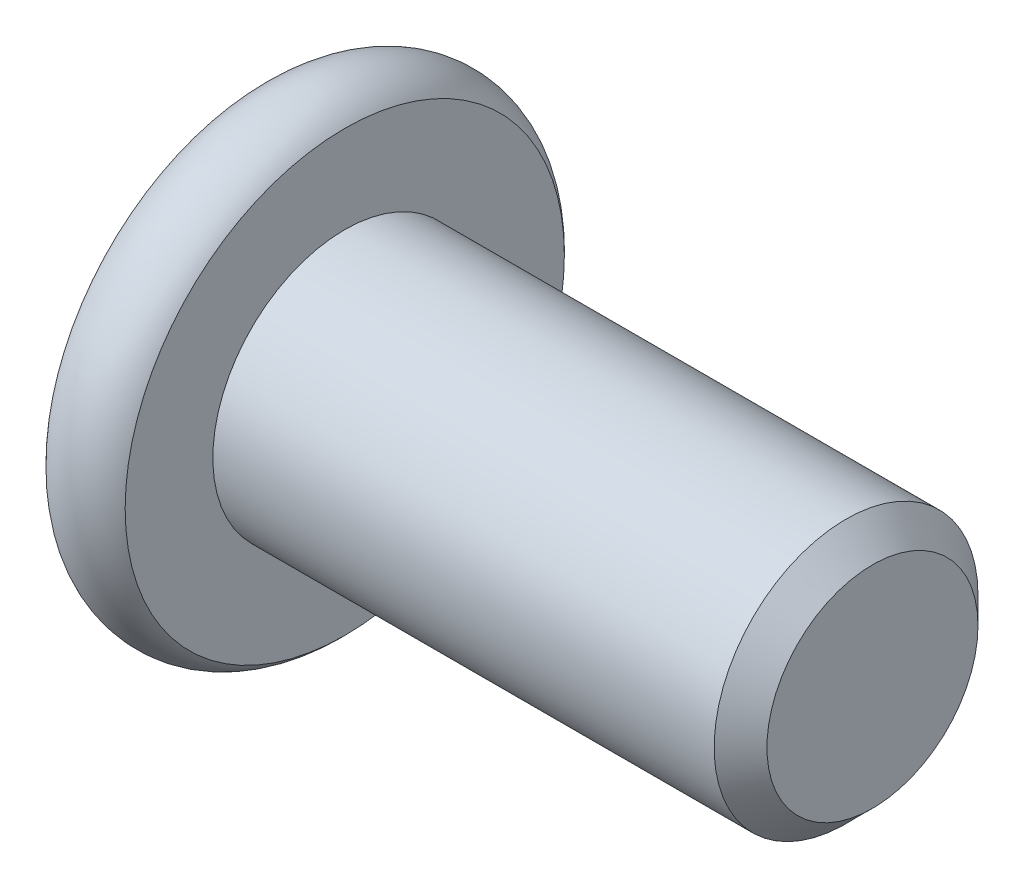
ISO-10303-21;
HEADER;
FILE_DESCRIPTION(('STEP AP214'),'2;1');
FILE_NAME('part.step','',(''),(''),'','','');
FILE_SCHEMA(('AUTOMOTIVE_DESIGN { 1 0 10303 214 1 1 1 1 }'));
ENDSEC;
DATA;
#1=APPLICATION_CONTEXT('core data for automotive mechanical design processes');
#2=APPLICATION_PROTOCOL_DEFINITION('international standard','automotive_design',2000,#1);
#3=PRODUCT_CONTEXT('',#1,'mechanical');
#4=PRODUCT('Part','Part','',(#3));
#5=PRODUCT_RELATED_PRODUCT_CATEGORY('part','',(#4));
#6=PRODUCT_DEFINITION_FORMATION('','',#4);
#7=PRODUCT_DEFINITION_CONTEXT('part definition',#1,'design');
#8=PRODUCT_DEFINITION('design','',#6,#7);
#9=PRODUCT_DEFINITION_SHAPE('','',#8);
#10=(LENGTH_UNIT() NAMED_UNIT(*) SI_UNIT(.MILLI.,.METRE.));
#11=(NAMED_UNIT(*) PLANE_ANGLE_UNIT() SI_UNIT($,.RADIAN.));
#12=(NAMED_UNIT(*) SI_UNIT($,.STERADIAN.) SOLID_ANGLE_UNIT());
#13=UNCERTAINTY_MEASURE_WITH_UNIT(LENGTH_MEASURE(1.E-05),#10,'distance_accuracy_value','');
#14=(GEOMETRIC_REPRESENTATION_CONTEXT(3) GLOBAL_UNCERTAINTY_ASSIGNED_CONTEXT((#13)) GLOBAL_UNIT_ASSIGNED_CONTEXT((#10,
#11,#12)) REPRESENTATION_CONTEXT('',''));
#15=CARTESIAN_POINT('',(0.,0.,0.));
#16=DIRECTION('',(0.,0.,1.));
#17=DIRECTION('',(1.,0.,0.));
#18=AXIS2_PLACEMENT_3D('',#15,#16,#17);
#19=CARTESIAN_POINT('',(-10.,0.,0.));
#20=DIRECTION('',(1.,0.,0.));
#21=DIRECTION('',(0.,0.,-1.));
#22=AXIS2_PLACEMENT_3D('',#19,#20,#21);
#23=CYLINDRICAL_SURFACE('',#22,2.5);
#24=CARTESIAN_POINT('',(-0.500000000000006,0.,0.));
#25=DIRECTION('',(1.,0.,0.));
#26=DIRECTION('',(0.,0.,-1.));
#27=AXIS2_PLACEMENT_3D('',#24,#25,#26);
#28=CIRCLE('',#27,2.5);
#29=CARTESIAN_POINT('',(-0.500000000000006,0.,-2.5));
#30=VERTEX_POINT('',#29);
#31=EDGE_CURVE('E49',#30,#30,#28,.F.);
#32=ORIENTED_EDGE('',*,*,#31,.T.);
#33=EDGE_LOOP('',(#32));
#34=FACE_BOUND('',#33,.T.);
#35=CARTESIAN_POINT('',(-10.,0.,0.));
#36=DIRECTION('',(1.,0.,0.));
#37=DIRECTION('',(0.,1.,0.));
#38=AXIS2_PLACEMENT_3D('',#35,#36,#37);
#39=CIRCLE('',#38,2.5);
#40=CARTESIAN_POINT('',(-10.,2.49999999999999,0.));
#41=VERTEX_POINT('',#40);
#42=EDGE_CURVE('E134',#41,#41,#39,.F.);
#43=ORIENTED_EDGE('',*,*,#42,.F.);
#44=EDGE_LOOP('',(#43));
#45=FACE_BOUND('',#44,.T.);
#46=ADVANCED_FACE('F35',(#34,#45),#23,.T.);
#47=CARTESIAN_POINT('',(0.,0.,0.));
#48=DIRECTION('',(1.,0.,0.));
#49=DIRECTION('',(0.,0.,-1.));
#50=AXIS2_PLACEMENT_3D('',#47,#48,#49);
#51=PLANE('',#50);
#52=CARTESIAN_POINT('',(0.,0.,0.));
#53=DIRECTION('',(1.,0.,0.));
#54=DIRECTION('',(0.,0.,-1.));
#55=AXIS2_PLACEMENT_3D('',#52,#53,#54);
#56=CIRCLE('',#55,1.99999999999999);
#57=CARTESIAN_POINT('',(0.,0.,-1.99999999999999));
#58=VERTEX_POINT('',#57);
#59=EDGE_CURVE('E138',#58,#58,#56,.T.);
#60=ORIENTED_EDGE('',*,*,#59,.T.);
#61=EDGE_LOOP('',(#60));
#62=FACE_BOUND('',#61,.T.);
#63=ADVANCED_FACE('F152',(#62),#51,.T.);
#64=CARTESIAN_POINT('',(0.,0.,0.));
#65=DIRECTION('',(-1.,0.,0.));
#66=DIRECTION('',(0.,0.,1.));
#67=AXIS2_PLACEMENT_3D('',#64,#65,#66);
#68=CONICAL_SURFACE('',#67,1.99999999999999,0.785398163397446);
#69=ORIENTED_EDGE('',*,*,#31,.F.);
#70=EDGE_LOOP('',(#69));
#71=FACE_BOUND('',#70,.T.);
#72=ORIENTED_EDGE('',*,*,#59,.F.);
#73=EDGE_LOOP('',(#72));
#74=FACE_BOUND('',#73,.T.);
#75=ADVANCED_FACE('F37',(#71,#74),#68,.T.);
#76=CARTESIAN_POINT('',(-11.5,0.,0.));
#77=DIRECTION('',(-1.,0.,0.));
#78=DIRECTION('',(0.,-1.,0.));
#79=AXIS2_PLACEMENT_3D('',#76,#77,#78);
#80=PLANE('',#79);
#81=CARTESIAN_POINT('',(-11.5,0.,0.));
#82=DIRECTION('',(-1.,0.,0.));
#83=DIRECTION('',(0.,-1.,0.));
#84=AXIS2_PLACEMENT_3D('',#81,#82,#83);
#85=CIRCLE('',#84,1.78205080756887);
#86=CARTESIAN_POINT('',(-11.5,-1.78205080756883,0.));
#87=VERTEX_POINT('',#86);
#88=EDGE_CURVE('E376',#87,#87,#85,.T.);
#89=ORIENTED_EDGE('',*,*,#88,.F.);
#90=EDGE_LOOP('',(#89));
#91=FACE_BOUND('',#90,.T.);
#92=CARTESIAN_POINT('',(-11.5,0.,0.));
#93=DIRECTION('',(1.,0.,0.));
#94=DIRECTION('',(0.,1.,0.));
#95=AXIS2_PLACEMENT_3D('',#92,#93,#94);
#96=CIRCLE('',#95,4.16143782776614);
#97=CARTESIAN_POINT('',(-11.5,4.16143782776614,0.));
#98=VERTEX_POINT('',#97);
#99=EDGE_CURVE('E130',#98,#98,#96,.T.);
#100=ORIENTED_EDGE('',*,*,#99,.F.);
#101=EDGE_LOOP('',(#100));
#102=FACE_BOUND('',#101,.T.);
#103=ADVANCED_FACE('F151',(#91,#102),#80,.T.);
#104=CARTESIAN_POINT('',(-10.75,0.,0.));
#105=DIRECTION('',(1.,0.,0.));
#106=DIRECTION('',(0.,1.,0.));
#107=AXIS2_PLACEMENT_3D('',#104,#105,#106);
#108=TOROIDAL_SURFACE('',#107,3.5,1.);
#109=ORIENTED_EDGE('',*,*,#99,.T.);
#110=EDGE_LOOP('',(#109));
#111=FACE_BOUND('',#110,.T.);
#112=CARTESIAN_POINT('',(-9.99999999999999,0.,0.));
#113=DIRECTION('',(1.,0.,0.));
#114=DIRECTION('',(0.,1.,0.));
#115=AXIS2_PLACEMENT_3D('',#112,#113,#114);
#116=CIRCLE('',#115,4.16143782776614);
#117=CARTESIAN_POINT('',(-10.,4.16143782776614,0.));
#118=VERTEX_POINT('',#117);
#119=EDGE_CURVE('E126',#118,#118,#116,.T.);
#120=ORIENTED_EDGE('',*,*,#119,.F.);
#121=EDGE_LOOP('',(#120));
#122=FACE_BOUND('',#121,.T.);
#123=ADVANCED_FACE('F163',(#111,#122),#108,.T.);
#124=CARTESIAN_POINT('',(-10.,4.16143782776614,0.));
#125=DIRECTION('',(1.,0.,0.));
#126=DIRECTION('',(0.,1.,0.));
#127=AXIS2_PLACEMENT_3D('',#124,#125,#126);
#128=PLANE('',#127);
#129=ORIENTED_EDGE('',*,*,#42,.T.);
#130=EDGE_LOOP('',(#129));
#131=FACE_BOUND('',#130,.T.);
#132=ORIENTED_EDGE('',*,*,#119,.T.);
#133=EDGE_LOOP('',(#132));
#134=FACE_BOUND('',#133,.T.);
#135=ADVANCED_FACE('F167',(#131,#134),#128,.T.);
#136=CARTESIAN_POINT('',(-11.5,0.,0.));
#137=DIRECTION('',(-1.,0.,0.));
#138=DIRECTION('',(0.,-1.,0.));
#139=AXIS2_PLACEMENT_3D('',#136,#137,#138);
#140=CONICAL_SURFACE('',#139,1.78205080756887,0.78539816339745);
#141=ORIENTED_EDGE('',*,*,#88,.T.);
#142=EDGE_LOOP('',(#141));
#143=FACE_BOUND('',#142,.T.);
#144=CARTESIAN_POINT('',(-12.015428085613,-1.74023253176579,1.5));
#145=CARTESIAN_POINT('',(-11.9833811073445,-1.69791724929732,1.5));
#146=CARTESIAN_POINT('',(-11.9516444672841,-1.65536760966793,1.5));
#147=CARTESIAN_POINT('',(-11.8889203936153,-1.56970398156686,1.5));
#148=CARTESIAN_POINT('',(-11.85793314822,-1.5265898554285,1.5));
#149=CARTESIAN_POINT('',(-11.765846164345,-1.39562626326564,1.5));
#150=CARTESIAN_POINT('',(-11.7061145123021,-1.30679868010577,1.5));
#151=CARTESIAN_POINT('',(-11.5887342891012,-1.12044622640216,1.5));
#152=CARTESIAN_POINT('',(-11.5314082774822,-1.02271587306674,1.5));
#153=CARTESIAN_POINT('',(-11.426463214976,-0.822357214965268,1.5));
#154=CARTESIAN_POINT('',(-11.3788114236896,-0.719746931701931,1.5));
#155=CARTESIAN_POINT('',(-11.320509988315,-0.565852387095104,1.5));
#156=CARTESIAN_POINT('',(-11.3037990535409,-0.516874191424692,1.5));
#157=CARTESIAN_POINT('',(-11.2743077515089,-0.417723988457531,1.5));
#158=CARTESIAN_POINT('',(-11.2615276514219,-0.367551900263897,1.5));
#159=CARTESIAN_POINT('',(-11.2407784202458,-0.267158299056148,1.5));
#160=CARTESIAN_POINT('',(-11.2327260618259,-0.216954261864884,1.5));
#161=CARTESIAN_POINT('',(-11.221591636834,-0.115994915871349,1.5));
#162=CARTESIAN_POINT('',(-11.2185086886377,-0.0652397064615661,1.5));
#163=CARTESIAN_POINT('',(-11.2175473897404,0.0344222234875302,1.5));
#164=CARTESIAN_POINT('',(-11.2194789216952,0.0833271701100644,1.5));
#165=CARTESIAN_POINT('',(-11.2280175729677,0.180724293127197,1.5));
#166=CARTESIAN_POINT('',(-11.234625142048,0.229216429361705,1.5));
#167=CARTESIAN_POINT('',(-11.2522650626447,0.326258027696984,1.5));
#168=CARTESIAN_POINT('',(-11.263373168201,0.374793507450005,1.5));
#169=CARTESIAN_POINT('',(-11.2894198669595,0.470802295834159,1.5));
#170=CARTESIAN_POINT('',(-11.3043581560035,0.518275688481262,1.5));
#171=CARTESIAN_POINT('',(-11.356839545716,0.667150562065111,1.5));
#172=CARTESIAN_POINT('',(-11.4003351165442,0.76644836242683,1.5));
#173=CARTESIAN_POINT('',(-11.4970587814836,0.960384405673816,1.5));
#174=CARTESIAN_POINT('',(-11.5503217226675,1.05500437383619,1.5));
#175=CARTESIAN_POINT('',(-11.6602258010453,1.2358452032153,1.5));
#176=CARTESIAN_POINT('',(-11.7165682531046,1.32224986946548,1.5));
#177=CARTESIAN_POINT('',(-11.803675572597,1.44954953726471,1.5));
#178=CARTESIAN_POINT('',(-11.8330199906839,1.49143368482421,1.5));
#179=CARTESIAN_POINT('',(-11.892486918293,1.57462914783242,1.5));
#180=CARTESIAN_POINT('',(-11.9226092115007,1.61594061772577,1.5));
#181=CARTESIAN_POINT('',(-11.9530541181365,1.65701358742551,1.5));
#182=B_SPLINE_CURVE_WITH_KNOTS('',3,(#144,#145,#146,#147,#148,#149,#150,#151,#152,#153,#154,
#155,#156,#157,#158,#159,#160,#161,#162,#163,#164,#165,#166,#167,#168,#169,#170,#171,#172,#173,
#174,#175,#176,#177,#178,#179,#180,#181),.UNSPECIFIED.,.F.,.F.,(4,2,2,2,2,2,2,2,2,2,2,2,2,2,2,2,
2,2,4),(0.,0.159238974218354,0.318517535014542,0.639504781932389,0.9791378937992,
1.31760168934357,1.47272233841624,1.62785352839776,1.78016486537347,1.93244917778279,
2.07904486260298,2.22565464958333,2.37484213303399,2.5240177730404,2.84828365283776,
3.1737297566675,3.48303030530537,3.63644667013909,3.78982082222913),.UNSPECIFIED.);
#183=CARTESIAN_POINT('',(-11.45,-0.866025403784405,1.5));
#184=VERTEX_POINT('',#183);
#185=CARTESIAN_POINT('',(-11.45,0.866025403784473,1.5));
#186=VERTEX_POINT('',#185);
#187=EDGE_CURVE('E104',#184,#186,#182,.T.);
#188=ORIENTED_EDGE('',*,*,#187,.F.);
#189=CARTESIAN_POINT('',(-11.4501154816001,-1.73216627762268,-0.0002000000000008));
#190=CARTESIAN_POINT('',(-11.4203654760673,-1.70239359975912,0.0513677907370747));
#191=CARTESIAN_POINT('',(-11.3923624839103,-1.67212305186352,0.1037979176652));
#192=CARTESIAN_POINT('',(-11.3410892304402,-1.61039789003616,0.210709034055596));
#193=CARTESIAN_POINT('',(-11.3178475050444,-1.57893740312611,0.26520019581466));
#194=CARTESIAN_POINT('',(-11.2780337289922,-1.51549879897984,0.375079081357248));
#195=CARTESIAN_POINT('',(-11.2613615856709,-1.48353684526807,0.430438809095199));
#196=CARTESIAN_POINT('',(-11.2356744568181,-1.41890915196208,0.54237725747715));
#197=CARTESIAN_POINT('',(-11.2266402904789,-1.38624538781115,0.598952556553008));
#198=CARTESIAN_POINT('',(-11.2184890812269,-1.32995210095296,0.696455389516441));
#199=CARTESIAN_POINT('',(-11.2172822529892,-1.30639533311121,0.737256908280466));
#200=CARTESIAN_POINT('',(-11.2193140571623,-1.2593233529019,0.818787969615858));
#201=CARTESIAN_POINT('',(-11.2225536707483,-1.2358081508531,0.85951749431463));
#202=CARTESIAN_POINT('',(-11.233291985982,-1.18900414978423,0.940584402163416));
#203=CARTESIAN_POINT('',(-11.2407946530187,-1.16571558211716,0.980921384598288));
#204=CARTESIAN_POINT('',(-11.2596516119283,-1.11952932016332,1.06091833691403));
#205=CARTESIAN_POINT('',(-11.2710075570186,-1.09663179808783,1.10057800851621));
#206=CARTESIAN_POINT('',(-11.3047216475927,-1.03798159809695,1.20216313477448));
#207=CARTESIAN_POINT('',(-11.3296218490934,-1.00259267147462,1.26345855370969));
#208=CARTESIAN_POINT('',(-11.3716566532716,-0.950557780604341,1.35358562846331));
#209=CARTESIAN_POINT('',(-11.3864251535591,-0.933410759677114,1.38328513990772));
#210=CARTESIAN_POINT('',(-11.4173105659402,-0.899432101996373,1.44213790138375));
#211=CARTESIAN_POINT('',(-11.4334268341217,-0.882600319285676,1.47129140422064));
#212=CARTESIAN_POINT('',(-11.4501154816001,-0.865909933730567,1.5002));
#213=B_SPLINE_CURVE_WITH_KNOTS('',3,(#189,#190,#191,#192,#193,#194,#195,#196,#197,#198,#199,
#200,#201,#202,#203,#204,#205,#206,#207,#208,#209,#210,#211,#212),.UNSPECIFIED.,.F.,.F.,(4,2,2,
2,2,2,2,2,2,2,2,4),(0.,0.199829143693304,0.400822987382389,0.598623720538181,0.795926240188889,
0.937113067959881,1.07833105577193,1.21968061668222,1.36109089931054,1.58570969637565,
1.69770705470963,1.80965120737193),.UNSPECIFIED.);
#214=CARTESIAN_POINT('',(-11.45,-1.73205080756884,0.));
#215=VERTEX_POINT('',#214);
#216=EDGE_CURVE('E209',#215,#184,#213,.T.);
#217=ORIENTED_EDGE('',*,*,#216,.F.);
#218=CARTESIAN_POINT('',(-11.4501154816001,-0.865909933730566,-1.5002));
#219=CARTESIAN_POINT('',(-11.4203654760673,-0.895682611594131,-1.44863220926292));
#220=CARTESIAN_POINT('',(-11.3923624839103,-0.92595315948973,-1.3962020823348));
#221=CARTESIAN_POINT('',(-11.3410892304402,-0.987678321317089,-1.2892909659444));
#222=CARTESIAN_POINT('',(-11.3178475050444,-1.01913880822714,-1.23479980418534));
#223=CARTESIAN_POINT('',(-11.2780337289922,-1.08257741237341,-1.12492091864275));
#224=CARTESIAN_POINT('',(-11.2613615856709,-1.11453936608518,-1.0695611909048));
#225=CARTESIAN_POINT('',(-11.2356744568181,-1.17916705939117,-0.95762274252285));
#226=CARTESIAN_POINT('',(-11.2266402904789,-1.2118308235421,-0.901047443446992));
#227=CARTESIAN_POINT('',(-11.2184890812269,-1.26812411040029,-0.80354461048356));
#228=CARTESIAN_POINT('',(-11.2172822529892,-1.29168087824204,-0.762743091719535));
#229=CARTESIAN_POINT('',(-11.2193140571623,-1.33875285845135,-0.681212030384143));
#230=CARTESIAN_POINT('',(-11.2225536707483,-1.36226806050015,-0.640482505685371));
#231=CARTESIAN_POINT('',(-11.233291985982,-1.40907206156902,-0.559415597836585));
#232=CARTESIAN_POINT('',(-11.2407946530187,-1.43236062923609,-0.519078615401713));
#233=CARTESIAN_POINT('',(-11.2596516119283,-1.47854689118993,-0.43908166308597));
#234=CARTESIAN_POINT('',(-11.2710075570186,-1.50144441326542,-0.399421991483793));
#235=CARTESIAN_POINT('',(-11.3047216475927,-1.5600946132563,-0.297836865225516));
#236=CARTESIAN_POINT('',(-11.3296218490934,-1.59548353987863,-0.236541446290312));
#237=CARTESIAN_POINT('',(-11.3716566532716,-1.64751843074891,-0.146414371536688));
#238=CARTESIAN_POINT('',(-11.3864251535591,-1.66466545167613,-0.116714860092283));
#239=CARTESIAN_POINT('',(-11.4173105659402,-1.69864410935687,-0.0578620986162504));
#240=CARTESIAN_POINT('',(-11.4334268341217,-1.71547589206757,-0.0287085957793641));
#241=CARTESIAN_POINT('',(-11.4501154816001,-1.73216627762268,0.000199999999998858));
#242=B_SPLINE_CURVE_WITH_KNOTS('',3,(#218,#219,#220,#221,#222,#223,#224,#225,#226,#227,#228,
#229,#230,#231,#232,#233,#234,#235,#236,#237,#238,#239,#240,#241),.UNSPECIFIED.,.F.,.F.,(4,2,2,
2,2,2,2,2,2,2,2,4),(0.,0.199829143693305,0.400822987382389,0.59862372053818,0.795926240188888,
0.937113067959881,1.07833105577193,1.21968061668222,1.36109089931054,1.58570969637565,
1.69770705470963,1.80965120737194),.UNSPECIFIED.);
#243=CARTESIAN_POINT('',(-11.45,-0.866025403784404,-1.5));
#244=VERTEX_POINT('',#243);
#245=EDGE_CURVE('E204',#244,#215,#242,.T.);
#246=ORIENTED_EDGE('',*,*,#245,.F.);
#247=CARTESIAN_POINT('',(-12.0154280857208,-1.74023253190811,-1.5));
#248=CARTESIAN_POINT('',(-11.9833811074482,-1.69791724943564,-1.5));
#249=CARTESIAN_POINT('',(-11.9516444673836,-1.65536760980222,-1.5));
#250=CARTESIAN_POINT('',(-11.8889203937065,-1.56970398169306,-1.5));
#251=CARTESIAN_POINT('',(-11.8579331483071,-1.52658985555063,-1.5));
#252=CARTESIAN_POINT('',(-11.7658461644196,-1.39562626337533,-1.5));
#253=CARTESIAN_POINT('',(-11.7061145123685,-1.306798680207,-1.5));
#254=CARTESIAN_POINT('',(-11.5887342891506,-1.12044622648493,-1.5));
#255=CARTESIAN_POINT('',(-11.5314082775229,-1.02271587313946,-1.5));
#256=CARTESIAN_POINT('',(-11.4264632150005,-0.822357215017057,-1.5));
#257=CARTESIAN_POINT('',(-11.3788114237067,-0.71974693174283,-1.5));
#258=CARTESIAN_POINT('',(-11.3205099883267,-0.565852387127821,-1.5));
#259=CARTESIAN_POINT('',(-11.3037990535528,-0.516874191460856,-1.5));
#260=CARTESIAN_POINT('',(-11.2743077515206,-0.417723988500704,-1.5));
#261=CARTESIAN_POINT('',(-11.2615276514332,-0.367551900310633,-1.5));
#262=CARTESIAN_POINT('',(-11.2407784202553,-0.267158299109893,-1.5));
#263=CARTESIAN_POINT('',(-11.2327260618342,-0.216954261922074,-1.5));
#264=CARTESIAN_POINT('',(-11.2215916368391,-0.115994915935319,-1.5));
#265=CARTESIAN_POINT('',(-11.2185086886407,-0.0652397065288699,-1.5));
#266=CARTESIAN_POINT('',(-11.2175473897388,0.0344222234141573,-1.5));
#267=CARTESIAN_POINT('',(-11.219478921691,0.0833271700339477,-1.5));
#268=CARTESIAN_POINT('',(-11.228017572958,0.180724293045873,-1.5));
#269=CARTESIAN_POINT('',(-11.2346251420354,0.229216429277916,-1.5));
#270=CARTESIAN_POINT('',(-11.2522650626259,0.326258027608331,-1.5));
#271=CARTESIAN_POINT('',(-11.2633731681789,0.374793507358958,-1.5));
#272=CARTESIAN_POINT('',(-11.2894198669309,0.470802295738561,-1.5));
#273=CARTESIAN_POINT('',(-11.3043581559716,0.518275688383506,-1.5));
#274=CARTESIAN_POINT('',(-11.3568395456685,0.667150561946159,-1.5));
#275=CARTESIAN_POINT('',(-11.4003351164823,0.766448362289901,-1.5));
#276=CARTESIAN_POINT('',(-11.4970587813916,0.960384405502316,-1.5));
#277=CARTESIAN_POINT('',(-11.5503217225595,1.0550043736481,-1.5));
#278=CARTESIAN_POINT('',(-11.6602258009069,1.2358452029974,-1.5));
#279=CARTESIAN_POINT('',(-11.7165682529518,1.32224986923424,-1.5));
#280=CARTESIAN_POINT('',(-11.8036755724226,1.44954953701376,-1.5));
#281=CARTESIAN_POINT('',(-11.8330199905024,1.49143368456679,-1.5));
#282=CARTESIAN_POINT('',(-11.8924869180973,1.57462914756209,-1.5));
#283=CARTESIAN_POINT('',(-11.9226092112979,1.615940617449,-1.5));
#284=CARTESIAN_POINT('',(-11.9530541179266,1.65701358714231,-1.5));
#285=B_SPLINE_CURVE_WITH_KNOTS('',3,(#247,#248,#249,#250,#251,#252,#253,#254,#255,#256,#257,
#258,#259,#260,#261,#262,#263,#264,#265,#266,#267,#268,#269,#270,#271,#272,#273,#274,#275,#276,
#277,#278,#279,#280,#281,#282,#283,#284),.UNSPECIFIED.,.F.,.F.,(4,2,2,2,2,2,2,2,2,2,2,2,2,2,2,2,
2,2,4),(0.,0.15923897423548,0.318517535048799,0.639504782001544,0.979137893907515,
1.31760168949067,1.47272233855335,1.6278535285249,1.78016486549105,1.93244917789081,
2.07904486270251,2.22565464967435,2.37484213311585,2.5240177731131,2.8482836528441,
3.17372975660706,3.48303030518781,3.63644666999335,3.78982082205522),.UNSPECIFIED.);
#286=CARTESIAN_POINT('',(-11.45,0.866025403784474,-1.5));
#287=VERTEX_POINT('',#286);
#288=EDGE_CURVE('E56',#287,#244,#285,.F.);
#289=ORIENTED_EDGE('',*,*,#288,.F.);
#290=CARTESIAN_POINT('',(-11.4501154816001,1.73216627762275,0.000200000000000434));
#291=CARTESIAN_POINT('',(-11.4203654760673,1.70239359975919,-0.0513677907370751));
#292=CARTESIAN_POINT('',(-11.3923624839103,1.67212305186359,-0.1037979176652));
#293=CARTESIAN_POINT('',(-11.3410892304401,1.61039789003623,-0.210709034055596));
#294=CARTESIAN_POINT('',(-11.3178475050444,1.57893740312618,-0.265200195814661));
#295=CARTESIAN_POINT('',(-11.2780337289922,1.51549879897991,-0.375079081357249));
#296=CARTESIAN_POINT('',(-11.2613615856709,1.48353684526814,-0.4304388090952));
#297=CARTESIAN_POINT('',(-11.2356744568181,1.41890915196215,-0.542377257477151));
#298=CARTESIAN_POINT('',(-11.2266402904789,1.38624538781122,-0.598952556553009));
#299=CARTESIAN_POINT('',(-11.2184890812269,1.32995210095303,-0.696455389516441));
#300=CARTESIAN_POINT('',(-11.2172822529892,1.30639533311127,-0.737256908280467));
#301=CARTESIAN_POINT('',(-11.2193140571623,1.25932335290197,-0.818787969615859));
#302=CARTESIAN_POINT('',(-11.2225536707483,1.23580815085317,-0.859517494314631));
#303=CARTESIAN_POINT('',(-11.233291985982,1.1890041497843,-0.940584402163417));
#304=CARTESIAN_POINT('',(-11.2407946530187,1.16571558211723,-0.980921384598289));
#305=CARTESIAN_POINT('',(-11.2596516119283,1.11952932016339,-1.06091833691403));
#306=CARTESIAN_POINT('',(-11.2710075570186,1.0966317980879,-1.10057800851621));
#307=CARTESIAN_POINT('',(-11.3047216475927,1.03798159809702,-1.20216313477449));
#308=CARTESIAN_POINT('',(-11.3296218490934,1.00259267147469,-1.26345855370969));
#309=CARTESIAN_POINT('',(-11.3716566532716,0.950557780604409,-1.35358562846331));
#310=CARTESIAN_POINT('',(-11.3864251535591,0.933410759677182,-1.38328513990772));
#311=CARTESIAN_POINT('',(-11.4173105659402,0.899432101996442,-1.44213790138375));
#312=CARTESIAN_POINT('',(-11.4334268341217,0.882600319285745,-1.47129140422064));
#313=CARTESIAN_POINT('',(-11.4501154816001,0.865909933730636,-1.5002));
#314=B_SPLINE_CURVE_WITH_KNOTS('',3,(#290,#291,#292,#293,#294,#295,#296,#297,#298,#299,#300,
#301,#302,#303,#304,#305,#306,#307,#308,#309,#310,#311,#312,#313),.UNSPECIFIED.,.F.,.F.,(4,2,2,
2,2,2,2,2,2,2,2,4),(0.,0.199829143693305,0.400822987382389,0.598623720538182,0.79592624018889,
0.937113067959883,1.07833105577193,1.21968061668222,1.36109089931055,1.58570969637566,
1.69770705470963,1.80965120737194),.UNSPECIFIED.);
#315=CARTESIAN_POINT('',(-11.45,1.73205080756891,0.));
#316=VERTEX_POINT('',#315);
#317=EDGE_CURVE('E11',#316,#287,#314,.T.);
#318=ORIENTED_EDGE('',*,*,#317,.F.);
#319=CARTESIAN_POINT('',(-11.4501154816001,0.865909933730636,1.5002));
#320=CARTESIAN_POINT('',(-11.4203654760673,0.8956826115942,1.44863220926292));
#321=CARTESIAN_POINT('',(-11.3923624839103,0.9259531594898,1.3962020823348));
#322=CARTESIAN_POINT('',(-11.3410892304401,0.987678321317157,1.2892909659444));
#323=CARTESIAN_POINT('',(-11.3178475050444,1.01913880822721,1.23479980418534));
#324=CARTESIAN_POINT('',(-11.2780337289922,1.08257741237348,1.12492091864275));
#325=CARTESIAN_POINT('',(-11.2613615856709,1.11453936608525,1.0695611909048));
#326=CARTESIAN_POINT('',(-11.2356744568181,1.17916705939124,0.95762274252285));
#327=CARTESIAN_POINT('',(-11.2266402904789,1.21183082354217,0.901047443446992));
#328=CARTESIAN_POINT('',(-11.2184890812269,1.26812411040035,0.80354461048356));
#329=CARTESIAN_POINT('',(-11.2172822529892,1.29168087824211,0.762743091719535));
#330=CARTESIAN_POINT('',(-11.2193140571623,1.33875285845141,0.681212030384143));
#331=CARTESIAN_POINT('',(-11.2225536707483,1.36226806050022,0.640482505685371));
#332=CARTESIAN_POINT('',(-11.233291985982,1.40907206156908,0.559415597836585));
#333=CARTESIAN_POINT('',(-11.2407946530187,1.43236062923615,0.519078615401713));
#334=CARTESIAN_POINT('',(-11.2596516119283,1.47854689119,0.43908166308597));
#335=CARTESIAN_POINT('',(-11.2710075570186,1.50144441326549,0.399421991483793));
#336=CARTESIAN_POINT('',(-11.3047216475927,1.56009461325637,0.297836865225516));
#337=CARTESIAN_POINT('',(-11.3296218490934,1.5954835398787,0.236541446290312));
#338=CARTESIAN_POINT('',(-11.3716566532716,1.64751843074898,0.146414371536687));
#339=CARTESIAN_POINT('',(-11.3864251535591,1.6646654516762,0.116714860092283));
#340=CARTESIAN_POINT('',(-11.4173105659402,1.69864410935694,0.0578620986162497));
#341=CARTESIAN_POINT('',(-11.4334268341217,1.71547589206764,0.0287085957793634));
#342=CARTESIAN_POINT('',(-11.4501154816001,1.73216627762275,-0.000199999999999442));
#343=B_SPLINE_CURVE_WITH_KNOTS('',3,(#319,#320,#321,#322,#323,#324,#325,#326,#327,#328,#329,
#330,#331,#332,#333,#334,#335,#336,#337,#338,#339,#340,#341,#342),.UNSPECIFIED.,.F.,.F.,(4,2,2,
2,2,2,2,2,2,2,2,4),(0.,0.199829143693304,0.400822987382387,0.598623720538179,0.795926240188887,
0.937113067959879,1.07833105577193,1.21968061668222,1.36109089931054,1.58570969637565,
1.69770705470963,1.80965120737194),.UNSPECIFIED.);
#344=EDGE_CURVE('E94',#186,#316,#343,.T.);
#345=ORIENTED_EDGE('',*,*,#344,.F.);
#346=EDGE_LOOP('',(#188,#217,#246,#289,#318,#345));
#347=FACE_BOUND('',#346,.T.);
#348=ADVANCED_FACE('F93',(#143,#347),#140,.F.);
#349=CARTESIAN_POINT('',(-9.2,0.,0.));
#350=DIRECTION('',(-1.,0.,0.));
#351=DIRECTION('',(0.,-1.,0.));
#352=AXIS2_PLACEMENT_3D('',#349,#350,#351);
#353=PLANE('',#352);
#354=DIRECTION('',(0.,0.5,-0.866025403784438));
#355=VECTOR('',#354,1.);
#356=CARTESIAN_POINT('',(-9.19999999999999,0.866025403784465,1.5));
#357=LINE('',#356,#355);
#358=CARTESIAN_POINT('',(-9.19999999999999,0.866025403784465,1.5));
#359=VERTEX_POINT('',#358);
#360=CARTESIAN_POINT('',(-9.19999999999999,1.7320508075689,0.));
#361=VERTEX_POINT('',#360);
#362=EDGE_CURVE('E103',#359,#361,#357,.T.);
#363=ORIENTED_EDGE('',*,*,#362,.T.);
#364=DIRECTION('',(0.,-0.5,-0.866025403784439));
#365=VECTOR('',#364,1.);
#366=CARTESIAN_POINT('',(-9.19999999999999,1.7320508075689,0.));
#367=LINE('',#366,#365);
#368=CARTESIAN_POINT('',(-9.19999999999999,0.866025403784465,-1.5));
#369=VERTEX_POINT('',#368);
#370=EDGE_CURVE('E108',#361,#369,#367,.T.);
#371=ORIENTED_EDGE('',*,*,#370,.T.);
#372=DIRECTION('',(0.,-1.,0.));
#373=VECTOR('',#372,1.);
#374=CARTESIAN_POINT('',(-9.19999999999999,0.866025403784465,-1.5));
#375=LINE('',#374,#373);
#376=CARTESIAN_POINT('',(-9.2,-0.866025403784413,-1.5));
#377=VERTEX_POINT('',#376);
#378=EDGE_CURVE('E235',#369,#377,#375,.T.);
#379=ORIENTED_EDGE('',*,*,#378,.T.);
#380=DIRECTION('',(0.,-0.5,0.866025403784439));
#381=VECTOR('',#380,1.);
#382=CARTESIAN_POINT('',(-9.2,-0.866025403784413,-1.5));
#383=LINE('',#382,#381);
#384=CARTESIAN_POINT('',(-9.2,-1.73205080756885,0.));
#385=VERTEX_POINT('',#384);
#386=EDGE_CURVE('E240',#377,#385,#383,.T.);
#387=ORIENTED_EDGE('',*,*,#386,.T.);
#388=DIRECTION('',(0.,0.5,0.866025403784439));
#389=VECTOR('',#388,1.);
#390=CARTESIAN_POINT('',(-9.2,-1.73205080756885,0.));
#391=LINE('',#390,#389);
#392=CARTESIAN_POINT('',(-9.2,-0.866025403784413,1.5));
#393=VERTEX_POINT('',#392);
#394=EDGE_CURVE('E122',#385,#393,#391,.T.);
#395=ORIENTED_EDGE('',*,*,#394,.T.);
#396=DIRECTION('',(0.,1.,0.));
#397=VECTOR('',#396,1.);
#398=CARTESIAN_POINT('',(-9.2,-0.866025403784413,1.5));
#399=LINE('',#398,#397);
#400=EDGE_CURVE('E112',#393,#359,#399,.T.);
#401=ORIENTED_EDGE('',*,*,#400,.T.);
#402=EDGE_LOOP('',(#363,#371,#379,#387,#395,#401));
#403=FACE_BOUND('',#402,.T.);
#404=ADVANCED_FACE('F191',(#403),#353,.T.);
#405=CARTESIAN_POINT('',(-9.19999999999999,1.7320508075689,0.));
#406=DIRECTION('',(0.,0.866025403784439,-0.5));
#407=DIRECTION('',(0.,0.5,0.866025403784439));
#408=AXIS2_PLACEMENT_3D('',#405,#406,#407);
#409=PLANE('',#408);
#410=DIRECTION('',(-1.,0.,0.));
#411=VECTOR('',#410,1.);
#412=CARTESIAN_POINT('',(-9.19999999999999,1.7320508075689,0.));
#413=LINE('',#412,#411);
#414=EDGE_CURVE('E100',#361,#316,#413,.T.);
#415=ORIENTED_EDGE('',*,*,#414,.T.);
#416=ORIENTED_EDGE('',*,*,#317,.T.);
#417=DIRECTION('',(-1.,0.,0.));
#418=VECTOR('',#417,1.);
#419=CARTESIAN_POINT('',(-9.19999999999999,0.866025403784465,-1.5));
#420=LINE('',#419,#418);
#421=EDGE_CURVE('E111',#369,#287,#420,.T.);
#422=ORIENTED_EDGE('',*,*,#421,.F.);
#423=ORIENTED_EDGE('',*,*,#370,.F.);
#424=EDGE_LOOP('',(#415,#416,#422,#423));
#425=FACE_BOUND('',#424,.T.);
#426=ADVANCED_FACE('F106',(#425),#409,.F.);
#427=CARTESIAN_POINT('',(-9.19999999999999,0.866025403784465,-1.5));
#428=DIRECTION('',(0.,0.,-1.));
#429=DIRECTION('',(0.,1.,0.));
#430=AXIS2_PLACEMENT_3D('',#427,#428,#429);
#431=PLANE('',#430);
#432=ORIENTED_EDGE('',*,*,#421,.T.);
#433=ORIENTED_EDGE('',*,*,#288,.T.);
#434=DIRECTION('',(-1.,0.,0.));
#435=VECTOR('',#434,1.);
#436=CARTESIAN_POINT('',(-9.2,-0.866025403784413,-1.5));
#437=LINE('',#436,#435);
#438=EDGE_CURVE('E118',#377,#244,#437,.T.);
#439=ORIENTED_EDGE('',*,*,#438,.F.);
#440=ORIENTED_EDGE('',*,*,#378,.F.);
#441=EDGE_LOOP('',(#432,#433,#439,#440));
#442=FACE_BOUND('',#441,.T.);
#443=ADVANCED_FACE('F224',(#442),#431,.F.);
#444=CARTESIAN_POINT('',(-9.2,-0.866025403784413,-1.5));
#445=DIRECTION('',(0.,-0.866025403784439,-0.5));
#446=DIRECTION('',(0.,0.5,-0.866025403784438));
#447=AXIS2_PLACEMENT_3D('',#444,#445,#446);
#448=PLANE('',#447);
#449=ORIENTED_EDGE('',*,*,#438,.T.);
#450=ORIENTED_EDGE('',*,*,#245,.T.);
#451=DIRECTION('',(-1.,0.,0.));
#452=VECTOR('',#451,1.);
#453=CARTESIAN_POINT('',(-9.2,-1.73205080756885,0.));
#454=LINE('',#453,#452);
#455=EDGE_CURVE('E256',#385,#215,#454,.T.);
#456=ORIENTED_EDGE('',*,*,#455,.F.);
#457=ORIENTED_EDGE('',*,*,#386,.F.);
#458=EDGE_LOOP('',(#449,#450,#456,#457));
#459=FACE_BOUND('',#458,.T.);
#460=ADVANCED_FACE('F219',(#459),#448,.F.);
#461=CARTESIAN_POINT('',(-9.2,-1.73205080756885,0.));
#462=DIRECTION('',(0.,-0.866025403784439,0.5));
#463=DIRECTION('',(0.,-0.5,-0.866025403784439));
#464=AXIS2_PLACEMENT_3D('',#461,#462,#463);
#465=PLANE('',#464);
#466=ORIENTED_EDGE('',*,*,#455,.T.);
#467=ORIENTED_EDGE('',*,*,#216,.T.);
#468=DIRECTION('',(-1.,0.,0.));
#469=VECTOR('',#468,1.);
#470=CARTESIAN_POINT('',(-9.2,-0.866025403784413,1.5));
#471=LINE('',#470,#469);
#472=EDGE_CURVE('E252',#393,#184,#471,.T.);
#473=ORIENTED_EDGE('',*,*,#472,.F.);
#474=ORIENTED_EDGE('',*,*,#394,.F.);
#475=EDGE_LOOP('',(#466,#467,#473,#474));
#476=FACE_BOUND('',#475,.T.);
#477=ADVANCED_FACE('F216',(#476),#465,.F.);
#478=CARTESIAN_POINT('',(-9.2,-0.866025403784413,1.5));
#479=DIRECTION('',(0.,0.,1.));
#480=DIRECTION('',(1.,0.,0.));
#481=AXIS2_PLACEMENT_3D('',#478,#479,#480);
#482=PLANE('',#481);
#483=ORIENTED_EDGE('',*,*,#472,.T.);
#484=ORIENTED_EDGE('',*,*,#187,.T.);
#485=DIRECTION('',(-1.,0.,0.));
#486=VECTOR('',#485,1.);
#487=CARTESIAN_POINT('',(-9.19999999999999,0.866025403784465,1.5));
#488=LINE('',#487,#486);
#489=EDGE_CURVE('E63',#359,#186,#488,.T.);
#490=ORIENTED_EDGE('',*,*,#489,.F.);
#491=ORIENTED_EDGE('',*,*,#400,.F.);
#492=EDGE_LOOP('',(#483,#484,#490,#491));
#493=FACE_BOUND('',#492,.T.);
#494=ADVANCED_FACE('F174',(#493),#482,.F.);
#495=CARTESIAN_POINT('',(-9.19999999999999,0.866025403784465,1.5));
#496=DIRECTION('',(0.,0.866025403784439,0.5));
#497=DIRECTION('',(0.,-0.5,0.866025403784439));
#498=AXIS2_PLACEMENT_3D('',#495,#496,#497);
#499=PLANE('',#498);
#500=ORIENTED_EDGE('',*,*,#489,.T.);
#501=ORIENTED_EDGE('',*,*,#344,.T.);
#502=ORIENTED_EDGE('',*,*,#414,.F.);
#503=ORIENTED_EDGE('',*,*,#362,.F.);
#504=EDGE_LOOP('',(#500,#501,#502,#503));
#505=FACE_BOUND('',#504,.T.);
#506=ADVANCED_FACE('F99',(#505),#499,.F.);
#507=CLOSED_SHELL('',(#46,#63,#75,#103,#123,#135,#348,#404,#426,#443,#460,#477,#494,#506));
#508=MANIFOLD_SOLID_BREP('B2',#507);
#509=ADVANCED_BREP_SHAPE_REPRESENTATION('',(#18,#508),#14);
#510=SHAPE_DEFINITION_REPRESENTATION(#9,#509);
ENDSEC;
END-ISO-10303-21;
